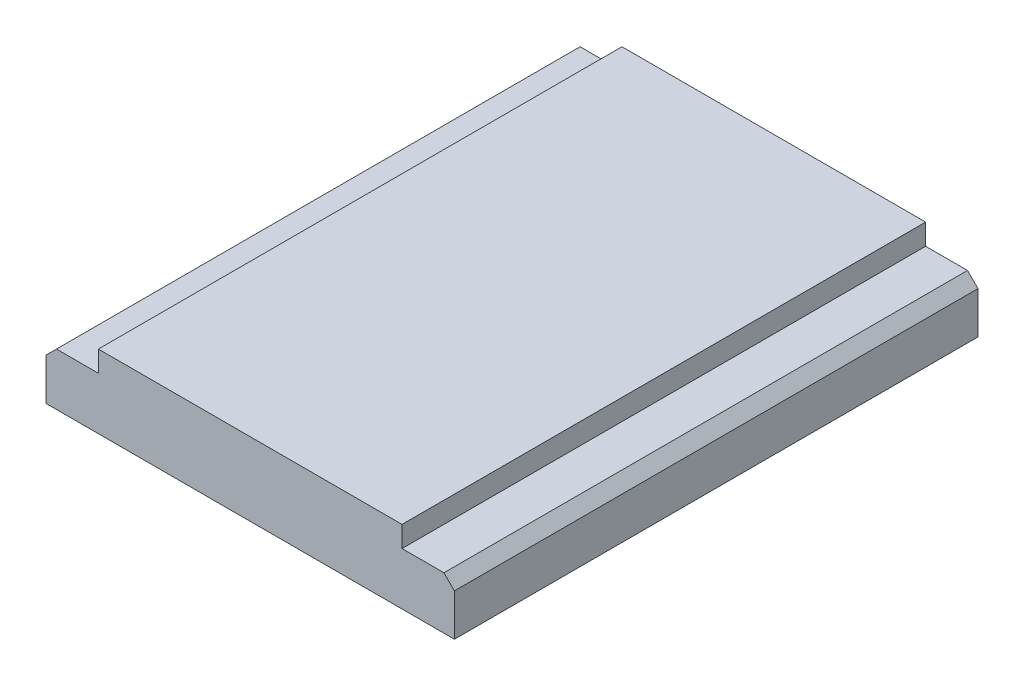
ISO-10303-21;
HEADER;
FILE_DESCRIPTION(('STEP AP214'),'2;1');
FILE_NAME('part.step','',(''),(''),'','','');
FILE_SCHEMA(('AUTOMOTIVE_DESIGN { 1 0 10303 214 1 1 1 1 }'));
ENDSEC;
DATA;
#1=APPLICATION_CONTEXT('core data for automotive mechanical design processes');
#2=APPLICATION_PROTOCOL_DEFINITION('international standard','automotive_design',2000,#1);
#3=PRODUCT_CONTEXT('',#1,'mechanical');
#4=PRODUCT('Part','Part','',(#3));
#5=PRODUCT_RELATED_PRODUCT_CATEGORY('part','',(#4));
#6=PRODUCT_DEFINITION_FORMATION('','',#4);
#7=PRODUCT_DEFINITION_CONTEXT('part definition',#1,'design');
#8=PRODUCT_DEFINITION('design','',#6,#7);
#9=PRODUCT_DEFINITION_SHAPE('','',#8);
#10=(LENGTH_UNIT() NAMED_UNIT(*) SI_UNIT(.MILLI.,.METRE.));
#11=(NAMED_UNIT(*) PLANE_ANGLE_UNIT() SI_UNIT($,.RADIAN.));
#12=(NAMED_UNIT(*) SI_UNIT($,.STERADIAN.) SOLID_ANGLE_UNIT());
#13=UNCERTAINTY_MEASURE_WITH_UNIT(LENGTH_MEASURE(1.E-05),#10,'distance_accuracy_value','');
#14=(GEOMETRIC_REPRESENTATION_CONTEXT(3) GLOBAL_UNCERTAINTY_ASSIGNED_CONTEXT((#13)) GLOBAL_UNIT_ASSIGNED_CONTEXT((#10,
#11,#12)) REPRESENTATION_CONTEXT('',''));
#15=CARTESIAN_POINT('',(0.,0.,0.));
#16=DIRECTION('',(0.,0.,1.));
#17=DIRECTION('',(1.,0.,0.));
#18=AXIS2_PLACEMENT_3D('',#15,#16,#17);
#19=CARTESIAN_POINT('',(0.,0.999999999999999,10.));
#20=DIRECTION('',(1.,0.,0.));
#21=DIRECTION('',(0.,0.,-1.));
#22=AXIS2_PLACEMENT_3D('',#19,#20,#21);
#23=PLANE('',#22);
#24=DIRECTION('',(0.,-1.,0.));
#25=VECTOR('',#24,1.);
#26=CARTESIAN_POINT('',(0.,0.999999999999999,10.));
#27=LINE('',#26,#25);
#28=CARTESIAN_POINT('',(0.,0.799999999999997,10.));
#29=VERTEX_POINT('',#28);
#30=CARTESIAN_POINT('',(0.,0.,10.));
#31=VERTEX_POINT('',#30);
#32=EDGE_CURVE('E111',#29,#31,#27,.T.);
#33=ORIENTED_EDGE('',*,*,#32,.F.);
#34=DIRECTION('',(0.,0.,-1.));
#35=VECTOR('',#34,1.);
#36=CARTESIAN_POINT('',(0.,0.799999999999997,10.));
#37=LINE('',#36,#35);
#38=CARTESIAN_POINT('',(0.,0.799999999999997,0.));
#39=VERTEX_POINT('',#38);
#40=EDGE_CURVE('E136',#29,#39,#37,.T.);
#41=ORIENTED_EDGE('',*,*,#40,.T.);
#42=DIRECTION('',(0.,-1.,0.));
#43=VECTOR('',#42,1.);
#44=CARTESIAN_POINT('',(0.,0.999999999999999,0.));
#45=LINE('',#44,#43);
#46=CARTESIAN_POINT('',(0.,0.,0.));
#47=VERTEX_POINT('',#46);
#48=EDGE_CURVE('E134',#39,#47,#45,.T.);
#49=ORIENTED_EDGE('',*,*,#48,.T.);
#50=DIRECTION('',(0.,0.,-1.));
#51=VECTOR('',#50,1.);
#52=CARTESIAN_POINT('',(0.,0.,10.));
#53=LINE('',#52,#51);
#54=EDGE_CURVE('E128',#31,#47,#53,.T.);
#55=ORIENTED_EDGE('',*,*,#54,.F.);
#56=EDGE_LOOP('',(#33,#41,#49,#55));
#57=FACE_BOUND('',#56,.T.);
#58=ADVANCED_FACE('F35',(#57),#23,.F.);
#59=CARTESIAN_POINT('',(0.,0.,10.));
#60=DIRECTION('',(0.,1.,0.));
#61=DIRECTION('',(0.,0.,1.));
#62=AXIS2_PLACEMENT_3D('',#59,#60,#61);
#63=PLANE('',#62);
#64=DIRECTION('',(1.,0.,0.));
#65=VECTOR('',#64,1.);
#66=CARTESIAN_POINT('',(0.,0.,0.));
#67=LINE('',#66,#65);
#68=CARTESIAN_POINT('',(7.8,0.,0.));
#69=VERTEX_POINT('',#68);
#70=EDGE_CURVE('E170',#47,#69,#67,.T.);
#71=ORIENTED_EDGE('',*,*,#70,.T.);
#72=DIRECTION('',(0.,0.,-1.));
#73=VECTOR('',#72,1.);
#74=CARTESIAN_POINT('',(7.8,0.,10.));
#75=LINE('',#74,#73);
#76=CARTESIAN_POINT('',(7.8,0.,10.));
#77=VERTEX_POINT('',#76);
#78=EDGE_CURVE('E130',#77,#69,#75,.T.);
#79=ORIENTED_EDGE('',*,*,#78,.F.);
#80=DIRECTION('',(1.,0.,0.));
#81=VECTOR('',#80,1.);
#82=CARTESIAN_POINT('',(0.,0.,10.));
#83=LINE('',#82,#81);
#84=EDGE_CURVE('E115',#31,#77,#83,.T.);
#85=ORIENTED_EDGE('',*,*,#84,.F.);
#86=ORIENTED_EDGE('',*,*,#54,.T.);
#87=EDGE_LOOP('',(#71,#79,#85,#86));
#88=FACE_BOUND('',#87,.T.);
#89=ADVANCED_FACE('F127',(#88),#63,.F.);
#90=CARTESIAN_POINT('',(7.8,0.,10.));
#91=DIRECTION('',(-1.,0.,0.));
#92=DIRECTION('',(0.,0.,1.));
#93=AXIS2_PLACEMENT_3D('',#90,#91,#92);
#94=PLANE('',#93);
#95=DIRECTION('',(0.,1.,0.));
#96=VECTOR('',#95,1.);
#97=CARTESIAN_POINT('',(7.8,0.,0.));
#98=LINE('',#97,#96);
#99=CARTESIAN_POINT('',(7.8,0.799999999999999,0.));
#100=VERTEX_POINT('',#99);
#101=EDGE_CURVE('E166',#69,#100,#98,.T.);
#102=ORIENTED_EDGE('',*,*,#101,.T.);
#103=DIRECTION('',(0.,0.,1.));
#104=VECTOR('',#103,1.);
#105=CARTESIAN_POINT('',(7.8,0.799999999999999,10.));
#106=LINE('',#105,#104);
#107=CARTESIAN_POINT('',(7.8,0.799999999999999,10.));
#108=VERTEX_POINT('',#107);
#109=EDGE_CURVE('E11',#100,#108,#106,.T.);
#110=ORIENTED_EDGE('',*,*,#109,.T.);
#111=DIRECTION('',(0.,1.,0.));
#112=VECTOR('',#111,1.);
#113=CARTESIAN_POINT('',(7.8,0.,10.));
#114=LINE('',#113,#112);
#115=EDGE_CURVE('E131',#77,#108,#114,.T.);
#116=ORIENTED_EDGE('',*,*,#115,.F.);
#117=ORIENTED_EDGE('',*,*,#78,.T.);
#118=EDGE_LOOP('',(#102,#110,#116,#117));
#119=FACE_BOUND('',#118,.T.);
#120=ADVANCED_FACE('F203',(#119),#94,.F.);
#121=CARTESIAN_POINT('',(7.8,1.,10.));
#122=DIRECTION('',(0.,-1.,0.));
#123=DIRECTION('',(0.,0.,-1.));
#124=AXIS2_PLACEMENT_3D('',#121,#122,#123);
#125=PLANE('',#124);
#126=DIRECTION('',(-1.,0.,0.));
#127=VECTOR('',#126,1.);
#128=CARTESIAN_POINT('',(7.8,1.,10.));
#129=LINE('',#128,#127);
#130=CARTESIAN_POINT('',(7.6,1.,10.));
#131=VERTEX_POINT('',#130);
#132=CARTESIAN_POINT('',(6.8,1.,10.));
#133=VERTEX_POINT('',#132);
#134=EDGE_CURVE('E158',#131,#133,#129,.T.);
#135=ORIENTED_EDGE('',*,*,#134,.F.);
#136=DIRECTION('',(0.,0.,-1.));
#137=VECTOR('',#136,1.);
#138=CARTESIAN_POINT('',(7.6,1.,10.));
#139=LINE('',#138,#137);
#140=CARTESIAN_POINT('',(7.6,1.,0.));
#141=VERTEX_POINT('',#140);
#142=EDGE_CURVE('E44',#131,#141,#139,.T.);
#143=ORIENTED_EDGE('',*,*,#142,.T.);
#144=DIRECTION('',(-1.,0.,0.));
#145=VECTOR('',#144,1.);
#146=CARTESIAN_POINT('',(7.8,1.,0.));
#147=LINE('',#146,#145);
#148=CARTESIAN_POINT('',(6.8,1.,0.));
#149=VERTEX_POINT('',#148);
#150=EDGE_CURVE('E156',#141,#149,#147,.T.);
#151=ORIENTED_EDGE('',*,*,#150,.T.);
#152=DIRECTION('',(0.,0.,-1.));
#153=VECTOR('',#152,1.);
#154=CARTESIAN_POINT('',(6.8,1.,10.));
#155=LINE('',#154,#153);
#156=EDGE_CURVE('E140',#133,#149,#155,.T.);
#157=ORIENTED_EDGE('',*,*,#156,.F.);
#158=EDGE_LOOP('',(#135,#143,#151,#157));
#159=FACE_BOUND('',#158,.T.);
#160=ADVANCED_FACE('F154',(#159),#125,.F.);
#161=CARTESIAN_POINT('',(6.8,1.,10.));
#162=DIRECTION('',(-1.,0.,0.));
#163=DIRECTION('',(0.,0.,1.));
#164=AXIS2_PLACEMENT_3D('',#161,#162,#163);
#165=PLANE('',#164);
#166=DIRECTION('',(0.,1.,0.));
#167=VECTOR('',#166,1.);
#168=CARTESIAN_POINT('',(6.8,1.,0.));
#169=LINE('',#168,#167);
#170=CARTESIAN_POINT('',(6.8,1.4,0.));
#171=VERTEX_POINT('',#170);
#172=EDGE_CURVE('E165',#149,#171,#169,.T.);
#173=ORIENTED_EDGE('',*,*,#172,.T.);
#174=DIRECTION('',(0.,0.,-1.));
#175=VECTOR('',#174,1.);
#176=CARTESIAN_POINT('',(6.8,1.4,10.));
#177=LINE('',#176,#175);
#178=CARTESIAN_POINT('',(6.8,1.4,10.));
#179=VERTEX_POINT('',#178);
#180=EDGE_CURVE('E186',#179,#171,#177,.T.);
#181=ORIENTED_EDGE('',*,*,#180,.F.);
#182=DIRECTION('',(0.,1.,0.));
#183=VECTOR('',#182,1.);
#184=CARTESIAN_POINT('',(6.8,1.,10.));
#185=LINE('',#184,#183);
#186=EDGE_CURVE('E192',#133,#179,#185,.T.);
#187=ORIENTED_EDGE('',*,*,#186,.F.);
#188=ORIENTED_EDGE('',*,*,#156,.T.);
#189=EDGE_LOOP('',(#173,#181,#187,#188));
#190=FACE_BOUND('',#189,.T.);
#191=ADVANCED_FACE('F190',(#190),#165,.F.);
#192=CARTESIAN_POINT('',(6.8,1.4,10.));
#193=DIRECTION('',(0.,-1.,0.));
#194=DIRECTION('',(1.,0.,0.));
#195=AXIS2_PLACEMENT_3D('',#192,#193,#194);
#196=PLANE('',#195);
#197=DIRECTION('',(-1.,0.,0.));
#198=VECTOR('',#197,1.);
#199=CARTESIAN_POINT('',(6.8,1.4,0.));
#200=LINE('',#199,#198);
#201=CARTESIAN_POINT('',(1.,1.4,0.));
#202=VERTEX_POINT('',#201);
#203=EDGE_CURVE('E168',#171,#202,#200,.T.);
#204=ORIENTED_EDGE('',*,*,#203,.T.);
#205=DIRECTION('',(0.,0.,-1.));
#206=VECTOR('',#205,1.);
#207=CARTESIAN_POINT('',(1.,1.4,10.));
#208=LINE('',#207,#206);
#209=CARTESIAN_POINT('',(1.,1.4,10.));
#210=VERTEX_POINT('',#209);
#211=EDGE_CURVE('E182',#210,#202,#208,.T.);
#212=ORIENTED_EDGE('',*,*,#211,.F.);
#213=DIRECTION('',(-1.,0.,0.));
#214=VECTOR('',#213,1.);
#215=CARTESIAN_POINT('',(6.8,1.4,10.));
#216=LINE('',#215,#214);
#217=EDGE_CURVE('E194',#179,#210,#216,.T.);
#218=ORIENTED_EDGE('',*,*,#217,.F.);
#219=ORIENTED_EDGE('',*,*,#180,.T.);
#220=EDGE_LOOP('',(#204,#212,#218,#219));
#221=FACE_BOUND('',#220,.T.);
#222=ADVANCED_FACE('F228',(#221),#196,.F.);
#223=CARTESIAN_POINT('',(1.,1.4,10.));
#224=DIRECTION('',(1.,0.,0.));
#225=DIRECTION('',(0.,0.,-1.));
#226=AXIS2_PLACEMENT_3D('',#223,#224,#225);
#227=PLANE('',#226);
#228=DIRECTION('',(0.,-1.,0.));
#229=VECTOR('',#228,1.);
#230=CARTESIAN_POINT('',(1.,1.4,0.));
#231=LINE('',#230,#229);
#232=CARTESIAN_POINT('',(1.,0.999999999999999,0.));
#233=VERTEX_POINT('',#232);
#234=EDGE_CURVE('E175',#202,#233,#231,.T.);
#235=ORIENTED_EDGE('',*,*,#234,.T.);
#236=DIRECTION('',(0.,0.,-1.));
#237=VECTOR('',#236,1.);
#238=CARTESIAN_POINT('',(1.,0.999999999999999,10.));
#239=LINE('',#238,#237);
#240=CARTESIAN_POINT('',(1.,0.999999999999999,10.));
#241=VERTEX_POINT('',#240);
#242=EDGE_CURVE('E179',#241,#233,#239,.T.);
#243=ORIENTED_EDGE('',*,*,#242,.F.);
#244=DIRECTION('',(0.,-1.,0.));
#245=VECTOR('',#244,1.);
#246=CARTESIAN_POINT('',(1.,1.4,10.));
#247=LINE('',#246,#245);
#248=EDGE_CURVE('E196',#210,#241,#247,.T.);
#249=ORIENTED_EDGE('',*,*,#248,.F.);
#250=ORIENTED_EDGE('',*,*,#211,.T.);
#251=EDGE_LOOP('',(#235,#243,#249,#250));
#252=FACE_BOUND('',#251,.T.);
#253=ADVANCED_FACE('F231',(#252),#227,.F.);
#254=CARTESIAN_POINT('',(1.,0.999999999999999,10.));
#255=DIRECTION('',(0.,-1.,0.));
#256=DIRECTION('',(1.,0.,0.));
#257=AXIS2_PLACEMENT_3D('',#254,#255,#256);
#258=PLANE('',#257);
#259=DIRECTION('',(-1.,0.,0.));
#260=VECTOR('',#259,1.);
#261=CARTESIAN_POINT('',(1.,0.999999999999999,0.));
#262=LINE('',#261,#260);
#263=CARTESIAN_POINT('',(0.200000000000002,0.999999999999999,0.));
#264=VERTEX_POINT('',#263);
#265=EDGE_CURVE('E123',#233,#264,#262,.T.);
#266=ORIENTED_EDGE('',*,*,#265,.T.);
#267=DIRECTION('',(0.,0.,1.));
#268=VECTOR('',#267,1.);
#269=CARTESIAN_POINT('',(0.200000000000002,0.999999999999999,10.));
#270=LINE('',#269,#268);
#271=CARTESIAN_POINT('',(0.200000000000002,0.999999999999999,10.));
#272=VERTEX_POINT('',#271);
#273=EDGE_CURVE('E147',#264,#272,#270,.T.);
#274=ORIENTED_EDGE('',*,*,#273,.T.);
#275=DIRECTION('',(-1.,0.,0.));
#276=VECTOR('',#275,1.);
#277=CARTESIAN_POINT('',(1.,0.999999999999999,10.));
#278=LINE('',#277,#276);
#279=EDGE_CURVE('E183',#241,#272,#278,.T.);
#280=ORIENTED_EDGE('',*,*,#279,.F.);
#281=ORIENTED_EDGE('',*,*,#242,.T.);
#282=EDGE_LOOP('',(#266,#274,#280,#281));
#283=FACE_BOUND('',#282,.T.);
#284=ADVANCED_FACE('F235',(#283),#258,.F.);
#285=CARTESIAN_POINT('',(0.,0.,10.));
#286=DIRECTION('',(0.,0.,1.));
#287=DIRECTION('',(1.,0.,0.));
#288=AXIS2_PLACEMENT_3D('',#285,#286,#287);
#289=PLANE('',#288);
#290=ORIENTED_EDGE('',*,*,#279,.T.);
#291=DIRECTION('',(0.707106781186548,0.707106781186547,0.));
#292=VECTOR('',#291,1.);
#293=CARTESIAN_POINT('',(-0.399999999999998,0.399999999999999,10.));
#294=LINE('',#293,#292);
#295=EDGE_CURVE('E118',#272,#29,#294,.F.);
#296=ORIENTED_EDGE('',*,*,#295,.T.);
#297=ORIENTED_EDGE('',*,*,#32,.T.);
#298=ORIENTED_EDGE('',*,*,#84,.T.);
#299=ORIENTED_EDGE('',*,*,#115,.T.);
#300=DIRECTION('',(0.707106781186548,-0.707106781186548,0.));
#301=VECTOR('',#300,1.);
#302=CARTESIAN_POINT('',(4.3,4.3,10.));
#303=LINE('',#302,#301);
#304=EDGE_CURVE('E51',#108,#131,#303,.F.);
#305=ORIENTED_EDGE('',*,*,#304,.T.);
#306=ORIENTED_EDGE('',*,*,#134,.T.);
#307=ORIENTED_EDGE('',*,*,#186,.T.);
#308=ORIENTED_EDGE('',*,*,#217,.T.);
#309=ORIENTED_EDGE('',*,*,#248,.T.);
#310=EDGE_LOOP('',(#290,#296,#297,#298,#299,#305,#306,#307,#308,#309));
#311=FACE_BOUND('',#310,.T.);
#312=ADVANCED_FACE('F114',(#311),#289,.T.);
#313=CARTESIAN_POINT('',(0.,0.,0.));
#314=DIRECTION('',(0.,0.,1.));
#315=DIRECTION('',(1.,0.,0.));
#316=AXIS2_PLACEMENT_3D('',#313,#314,#315);
#317=PLANE('',#316);
#318=ORIENTED_EDGE('',*,*,#48,.F.);
#319=DIRECTION('',(-0.707106781186548,-0.707106781186547,0.));
#320=VECTOR('',#319,1.);
#321=CARTESIAN_POINT('',(0.,0.799999999999997,0.));
#322=LINE('',#321,#320);
#323=EDGE_CURVE('E145',#39,#264,#322,.F.);
#324=ORIENTED_EDGE('',*,*,#323,.T.);
#325=ORIENTED_EDGE('',*,*,#265,.F.);
#326=ORIENTED_EDGE('',*,*,#234,.F.);
#327=ORIENTED_EDGE('',*,*,#203,.F.);
#328=ORIENTED_EDGE('',*,*,#172,.F.);
#329=ORIENTED_EDGE('',*,*,#150,.F.);
#330=DIRECTION('',(-0.707106781186548,0.707106781186548,0.));
#331=VECTOR('',#330,1.);
#332=CARTESIAN_POINT('',(7.6,1.,0.));
#333=LINE('',#332,#331);
#334=EDGE_CURVE('E138',#141,#100,#333,.F.);
#335=ORIENTED_EDGE('',*,*,#334,.T.);
#336=ORIENTED_EDGE('',*,*,#101,.F.);
#337=ORIENTED_EDGE('',*,*,#70,.F.);
#338=EDGE_LOOP('',(#318,#324,#325,#326,#327,#328,#329,#335,#336,#337));
#339=FACE_BOUND('',#338,.T.);
#340=ADVANCED_FACE('F162',(#339),#317,.F.);
#341=CARTESIAN_POINT('',(0.,0.799999999999997,10.));
#342=DIRECTION('',(0.707106781186547,-0.707106781186548,0.));
#343=DIRECTION('',(0.,0.,-1.));
#344=AXIS2_PLACEMENT_3D('',#341,#342,#343);
#345=PLANE('',#344);
#346=ORIENTED_EDGE('',*,*,#295,.F.);
#347=ORIENTED_EDGE('',*,*,#273,.F.);
#348=ORIENTED_EDGE('',*,*,#323,.F.);
#349=ORIENTED_EDGE('',*,*,#40,.F.);
#350=EDGE_LOOP('',(#346,#347,#348,#349));
#351=FACE_BOUND('',#350,.T.);
#352=ADVANCED_FACE('F205',(#351),#345,.F.);
#353=CARTESIAN_POINT('',(7.6,1.,10.));
#354=DIRECTION('',(-0.707106781186547,-0.707106781186547,0.));
#355=DIRECTION('',(0.,0.,-1.));
#356=AXIS2_PLACEMENT_3D('',#353,#354,#355);
#357=PLANE('',#356);
#358=ORIENTED_EDGE('',*,*,#304,.F.);
#359=ORIENTED_EDGE('',*,*,#109,.F.);
#360=ORIENTED_EDGE('',*,*,#334,.F.);
#361=ORIENTED_EDGE('',*,*,#142,.F.);
#362=EDGE_LOOP('',(#358,#359,#360,#361));
#363=FACE_BOUND('',#362,.T.);
#364=ADVANCED_FACE('F38',(#363),#357,.F.);
#365=CLOSED_SHELL('',(#58,#89,#120,#160,#191,#222,#253,#284,#312,#340,#352,#364));
#366=MANIFOLD_SOLID_BREP('B2',#365);
#367=ADVANCED_BREP_SHAPE_REPRESENTATION('',(#18,#366),#14);
#368=SHAPE_DEFINITION_REPRESENTATION(#9,#367);
ENDSEC;
END-ISO-10303-21;
